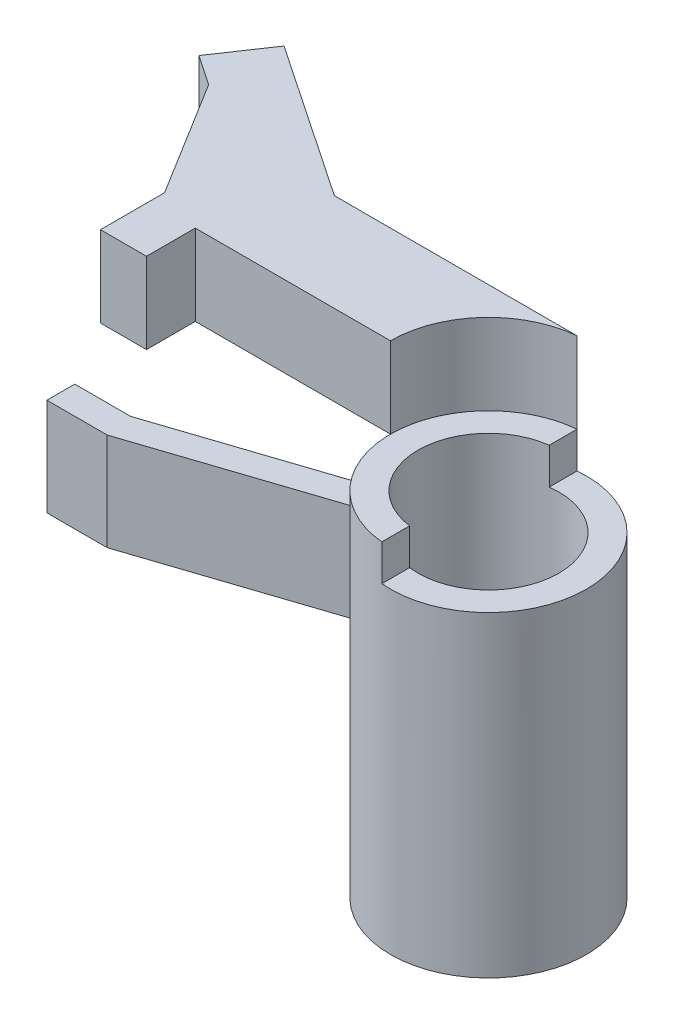
ISO-10303-21;
HEADER;
FILE_DESCRIPTION(('STEP AP214'),'2;1');
FILE_NAME('part.step','',(''),(''),'','','');
FILE_SCHEMA(('AUTOMOTIVE_DESIGN { 1 0 10303 214 1 1 1 1 }'));
ENDSEC;
DATA;
#1=APPLICATION_CONTEXT('core data for automotive mechanical design processes');
#2=APPLICATION_PROTOCOL_DEFINITION('international standard','automotive_design',2000,#1);
#3=PRODUCT_CONTEXT('',#1,'mechanical');
#4=PRODUCT('Part','Part','',(#3));
#5=PRODUCT_RELATED_PRODUCT_CATEGORY('part','',(#4));
#6=PRODUCT_DEFINITION_FORMATION('','',#4);
#7=PRODUCT_DEFINITION_CONTEXT('part definition',#1,'design');
#8=PRODUCT_DEFINITION('design','',#6,#7);
#9=PRODUCT_DEFINITION_SHAPE('','',#8);
#10=(LENGTH_UNIT() NAMED_UNIT(*) SI_UNIT(.MILLI.,.METRE.));
#11=(NAMED_UNIT(*) PLANE_ANGLE_UNIT() SI_UNIT($,.RADIAN.));
#12=(NAMED_UNIT(*) SI_UNIT($,.STERADIAN.) SOLID_ANGLE_UNIT());
#13=UNCERTAINTY_MEASURE_WITH_UNIT(LENGTH_MEASURE(1.E-05),#10,'distance_accuracy_value','');
#14=(GEOMETRIC_REPRESENTATION_CONTEXT(3) GLOBAL_UNCERTAINTY_ASSIGNED_CONTEXT((#13)) GLOBAL_UNIT_ASSIGNED_CONTEXT((#10,
#11,#12)) REPRESENTATION_CONTEXT('',''));
#15=CARTESIAN_POINT('',(0.,0.,0.));
#16=DIRECTION('',(0.,0.,1.));
#17=DIRECTION('',(1.,0.,0.));
#18=AXIS2_PLACEMENT_3D('',#15,#16,#17);
#19=CARTESIAN_POINT('',(0.,15.55,0.));
#20=DIRECTION('',(0.,-1.,0.));
#21=DIRECTION('',(0.,0.,-1.));
#22=AXIS2_PLACEMENT_3D('',#19,#20,#21);
#23=CYLINDRICAL_SURFACE('',#22,3.515);
#24=CARTESIAN_POINT('',(0.,12.65,0.));
#25=DIRECTION('',(0.,-1.,0.));
#26=DIRECTION('',(0.,0.,1.));
#27=AXIS2_PLACEMENT_3D('',#24,#25,#26);
#28=CIRCLE('',#27,3.515);
#29=CARTESIAN_POINT('',(-3.515,12.65,0.));
#30=VERTEX_POINT('',#29);
#31=CARTESIAN_POINT('',(-0.324384031666174,12.65,-3.5));
#32=VERTEX_POINT('',#31);
#33=EDGE_CURVE('E159',#30,#32,#28,.T.);
#34=ORIENTED_EDGE('',*,*,#33,.T.);
#35=DIRECTION('',(0.,-1.,0.));
#36=VECTOR('',#35,1.);
#37=CARTESIAN_POINT('',(-0.324384031666174,15.55,-3.5));
#38=LINE('',#37,#36);
#39=CARTESIAN_POINT('',(-0.324384031666174,15.55,-3.5));
#40=VERTEX_POINT('',#39);
#41=EDGE_CURVE('E12',#40,#32,#38,.T.);
#42=ORIENTED_EDGE('',*,*,#41,.F.);
#43=CARTESIAN_POINT('',(0.,15.55,0.));
#44=DIRECTION('',(0.,-1.,0.));
#45=DIRECTION('',(0.,0.,1.));
#46=AXIS2_PLACEMENT_3D('',#43,#44,#45);
#47=CIRCLE('',#46,3.515);
#48=CARTESIAN_POINT('',(-3.515,15.55,0.));
#49=VERTEX_POINT('',#48);
#50=EDGE_CURVE('E177',#49,#40,#47,.T.);
#51=ORIENTED_EDGE('',*,*,#50,.F.);
#52=DIRECTION('',(0.,-1.,0.));
#53=VECTOR('',#52,1.);
#54=CARTESIAN_POINT('',(-3.515,15.55,0.));
#55=LINE('',#54,#53);
#56=EDGE_CURVE('E155',#49,#30,#55,.T.);
#57=ORIENTED_EDGE('',*,*,#56,.T.);
#58=EDGE_LOOP('',(#34,#42,#51,#57));
#59=FACE_BOUND('',#58,.T.);
#60=ADVANCED_FACE('F51',(#59),#23,.F.);
#61=CARTESIAN_POINT('',(-0.324384031666174,15.55,-3.5));
#62=DIRECTION('',(0.,0.,1.));
#63=DIRECTION('',(1.,0.,0.));
#64=AXIS2_PLACEMENT_3D('',#61,#62,#63);
#65=PLANE('',#64);
#66=DIRECTION('',(-1.,0.,0.));
#67=VECTOR('',#66,1.);
#68=CARTESIAN_POINT('',(-0.324384031666174,12.65,-3.5));
#69=LINE('',#68,#67);
#70=CARTESIAN_POINT('',(-9.02438403166617,12.65,-3.5));
#71=VERTEX_POINT('',#70);
#72=EDGE_CURVE('E162',#32,#71,#69,.T.);
#73=ORIENTED_EDGE('',*,*,#72,.T.);
#74=DIRECTION('',(0.,-1.,0.));
#75=VECTOR('',#74,1.);
#76=CARTESIAN_POINT('',(-9.02438403166617,15.55,-3.5));
#77=LINE('',#76,#75);
#78=CARTESIAN_POINT('',(-9.02438403166617,15.55,-3.5));
#79=VERTEX_POINT('',#78);
#80=EDGE_CURVE('E59',#79,#71,#77,.T.);
#81=ORIENTED_EDGE('',*,*,#80,.F.);
#82=DIRECTION('',(-1.,0.,0.));
#83=VECTOR('',#82,1.);
#84=CARTESIAN_POINT('',(-0.324384031666174,15.55,-3.5));
#85=LINE('',#84,#83);
#86=EDGE_CURVE('E116',#40,#79,#85,.T.);
#87=ORIENTED_EDGE('',*,*,#86,.F.);
#88=ORIENTED_EDGE('',*,*,#41,.T.);
#89=EDGE_LOOP('',(#73,#81,#87,#88));
#90=FACE_BOUND('',#89,.T.);
#91=ADVANCED_FACE('F226',(#90),#65,.F.);
#92=CARTESIAN_POINT('',(-9.02438403166617,15.55,-3.5));
#93=DIRECTION('',(-0.559192903470748,0.,0.829037572555041));
#94=DIRECTION('',(0.829037572555041,0.,0.559192903470748));
#95=AXIS2_PLACEMENT_3D('',#92,#93,#94);
#96=PLANE('',#95);
#97=DIRECTION('',(-0.829037572555041,0.,-0.559192903470748));
#98=VECTOR('',#97,1.);
#99=CARTESIAN_POINT('',(-9.02438403166617,12.65,-3.5));
#100=LINE('',#99,#98);
#101=CARTESIAN_POINT('',(-14.5789357677849,12.65,-7.24659245325401));
#102=VERTEX_POINT('',#101);
#103=EDGE_CURVE('E164',#71,#102,#100,.T.);
#104=ORIENTED_EDGE('',*,*,#103,.T.);
#105=DIRECTION('',(0.,-1.,0.));
#106=VECTOR('',#105,1.);
#107=CARTESIAN_POINT('',(-14.5789357677849,15.55,-7.24659245325401));
#108=LINE('',#107,#106);
#109=CARTESIAN_POINT('',(-14.5789357677849,15.55,-7.24659245325401));
#110=VERTEX_POINT('',#109);
#111=EDGE_CURVE('E190',#110,#102,#108,.T.);
#112=ORIENTED_EDGE('',*,*,#111,.F.);
#113=DIRECTION('',(-0.829037572555041,0.,-0.559192903470748));
#114=VECTOR('',#113,1.);
#115=CARTESIAN_POINT('',(-9.02438403166617,15.55,-3.5));
#116=LINE('',#115,#114);
#117=EDGE_CURVE('E198',#79,#110,#116,.T.);
#118=ORIENTED_EDGE('',*,*,#117,.F.);
#119=ORIENTED_EDGE('',*,*,#80,.T.);
#120=EDGE_LOOP('',(#104,#112,#118,#119));
#121=FACE_BOUND('',#120,.T.);
#122=ADVANCED_FACE('F196',(#121),#96,.F.);
#123=CARTESIAN_POINT('',(-14.5789357677849,15.55,-7.24659245325401));
#124=DIRECTION('',(0.829037572555041,0.,0.559192903470748));
#125=DIRECTION('',(0.559192903470748,0.,-0.829037572555041));
#126=AXIS2_PLACEMENT_3D('',#123,#124,#125);
#127=PLANE('',#126);
#128=DIRECTION('',(-0.559192903470748,0.,0.829037572555041));
#129=VECTOR('',#128,1.);
#130=CARTESIAN_POINT('',(-14.5789357677849,12.65,-7.24659245325401));
#131=LINE('',#130,#129);
#132=CARTESIAN_POINT('',(-15.8091601554206,12.65,-5.42270979363292));
#133=VERTEX_POINT('',#132);
#134=EDGE_CURVE('E166',#102,#133,#131,.T.);
#135=ORIENTED_EDGE('',*,*,#134,.T.);
#136=DIRECTION('',(0.,-1.,0.));
#137=VECTOR('',#136,1.);
#138=CARTESIAN_POINT('',(-15.8091601554206,15.55,-5.42270979363292));
#139=LINE('',#138,#137);
#140=CARTESIAN_POINT('',(-15.8091601554206,15.55,-5.42270979363292));
#141=VERTEX_POINT('',#140);
#142=EDGE_CURVE('E187',#141,#133,#139,.T.);
#143=ORIENTED_EDGE('',*,*,#142,.F.);
#144=DIRECTION('',(-0.559192903470748,0.,0.829037572555041));
#145=VECTOR('',#144,1.);
#146=CARTESIAN_POINT('',(-14.5789357677849,15.55,-7.24659245325401));
#147=LINE('',#146,#145);
#148=EDGE_CURVE('E216',#110,#141,#147,.T.);
#149=ORIENTED_EDGE('',*,*,#148,.F.);
#150=ORIENTED_EDGE('',*,*,#111,.T.);
#151=EDGE_LOOP('',(#135,#143,#149,#150));
#152=FACE_BOUND('',#151,.T.);
#153=ADVANCED_FACE('F207',(#152),#127,.F.);
#154=CARTESIAN_POINT('',(-15.8091601554206,15.55,-5.42270979363292));
#155=DIRECTION('',(0.559192903470747,0.,-0.829037572555041));
#156=DIRECTION('',(-0.829037572555042,0.,-0.559192903470747));
#157=AXIS2_PLACEMENT_3D('',#154,#155,#156);
#158=PLANE('',#157);
#159=DIRECTION('',(0.829037572555041,0.,0.559192903470747));
#160=VECTOR('',#159,1.);
#161=CARTESIAN_POINT('',(-15.8091601554206,12.65,-5.42270979363292));
#162=LINE('',#161,#160);
#163=CARTESIAN_POINT('',(-14.731411311099,12.65,-4.69575901912095));
#164=VERTEX_POINT('',#163);
#165=EDGE_CURVE('E168',#133,#164,#162,.T.);
#166=ORIENTED_EDGE('',*,*,#165,.T.);
#167=DIRECTION('',(0.,-1.,0.));
#168=VECTOR('',#167,1.);
#169=CARTESIAN_POINT('',(-14.731411311099,15.55,-4.69575901912095));
#170=LINE('',#169,#168);
#171=CARTESIAN_POINT('',(-14.731411311099,15.55,-4.69575901912095));
#172=VERTEX_POINT('',#171);
#173=EDGE_CURVE('E184',#172,#164,#170,.T.);
#174=ORIENTED_EDGE('',*,*,#173,.F.);
#175=DIRECTION('',(0.829037572555041,0.,0.559192903470747));
#176=VECTOR('',#175,1.);
#177=CARTESIAN_POINT('',(-15.8091601554206,15.55,-5.42270979363292));
#178=LINE('',#177,#176);
#179=EDGE_CURVE('E213',#141,#172,#178,.T.);
#180=ORIENTED_EDGE('',*,*,#179,.F.);
#181=ORIENTED_EDGE('',*,*,#142,.T.);
#182=EDGE_LOOP('',(#166,#174,#180,#181));
#183=FACE_BOUND('',#182,.T.);
#184=ADVANCED_FACE('F211',(#183),#158,.F.);
#185=CARTESIAN_POINT('',(-12.165,15.55,-0.549999999999999));
#186=DIRECTION('',(0.850266150734693,0.,-0.526352992691034));
#187=DIRECTION('',(-0.526352992691034,0.,-0.850266150734693));
#188=AXIS2_PLACEMENT_3D('',#185,#186,#187);
#189=PLANE('',#188);
#190=DIRECTION('',(0.526352992691034,0.,0.850266150734693));
#191=VECTOR('',#190,1.);
#192=CARTESIAN_POINT('',(-12.165,12.65,-0.549999999999999));
#193=LINE('',#192,#191);
#194=CARTESIAN_POINT('',(-12.165,12.65,-0.549999999999999));
#195=VERTEX_POINT('',#194);
#196=EDGE_CURVE('E170',#164,#195,#193,.T.);
#197=ORIENTED_EDGE('',*,*,#196,.T.);
#198=DIRECTION('',(0.,-1.,0.));
#199=VECTOR('',#198,1.);
#200=CARTESIAN_POINT('',(-12.165,15.55,-0.549999999999999));
#201=LINE('',#200,#199);
#202=CARTESIAN_POINT('',(-12.165,15.55,-0.549999999999999));
#203=VERTEX_POINT('',#202);
#204=EDGE_CURVE('E181',#203,#195,#201,.T.);
#205=ORIENTED_EDGE('',*,*,#204,.F.);
#206=DIRECTION('',(0.526352992691034,0.,0.850266150734693));
#207=VECTOR('',#206,1.);
#208=CARTESIAN_POINT('',(-12.165,15.55,-0.549999999999999));
#209=LINE('',#208,#207);
#210=EDGE_CURVE('E215',#172,#203,#209,.T.);
#211=ORIENTED_EDGE('',*,*,#210,.F.);
#212=ORIENTED_EDGE('',*,*,#173,.T.);
#213=EDGE_LOOP('',(#197,#205,#211,#212));
#214=FACE_BOUND('',#213,.T.);
#215=ADVANCED_FACE('F238',(#214),#189,.F.);
#216=CARTESIAN_POINT('',(-12.165,15.55,1.75));
#217=DIRECTION('',(1.,0.,0.));
#218=DIRECTION('',(0.,0.,-1.));
#219=AXIS2_PLACEMENT_3D('',#216,#217,#218);
#220=PLANE('',#219);
#221=DIRECTION('',(0.,0.,1.));
#222=VECTOR('',#221,1.);
#223=CARTESIAN_POINT('',(-12.165,12.65,1.75));
#224=LINE('',#223,#222);
#225=CARTESIAN_POINT('',(-12.165,12.65,1.75));
#226=VERTEX_POINT('',#225);
#227=EDGE_CURVE('E172',#195,#226,#224,.T.);
#228=ORIENTED_EDGE('',*,*,#227,.T.);
#229=DIRECTION('',(0.,-1.,0.));
#230=VECTOR('',#229,1.);
#231=CARTESIAN_POINT('',(-12.165,15.55,1.75));
#232=LINE('',#231,#230);
#233=CARTESIAN_POINT('',(-12.165,15.55,1.75));
#234=VERTEX_POINT('',#233);
#235=EDGE_CURVE('E150',#234,#226,#232,.T.);
#236=ORIENTED_EDGE('',*,*,#235,.F.);
#237=DIRECTION('',(0.,0.,1.));
#238=VECTOR('',#237,1.);
#239=CARTESIAN_POINT('',(-12.165,15.55,1.75));
#240=LINE('',#239,#238);
#241=EDGE_CURVE('E141',#203,#234,#240,.T.);
#242=ORIENTED_EDGE('',*,*,#241,.F.);
#243=ORIENTED_EDGE('',*,*,#204,.T.);
#244=EDGE_LOOP('',(#228,#236,#242,#243));
#245=FACE_BOUND('',#244,.T.);
#246=ADVANCED_FACE('F241',(#245),#220,.F.);
#247=CARTESIAN_POINT('',(-10.515,15.55,1.75));
#248=DIRECTION('',(0.,0.,-1.));
#249=DIRECTION('',(-1.,0.,0.));
#250=AXIS2_PLACEMENT_3D('',#247,#248,#249);
#251=PLANE('',#250);
#252=DIRECTION('',(1.,0.,0.));
#253=VECTOR('',#252,1.);
#254=CARTESIAN_POINT('',(-10.515,12.65,1.75));
#255=LINE('',#254,#253);
#256=CARTESIAN_POINT('',(-10.515,12.65,1.75));
#257=VERTEX_POINT('',#256);
#258=EDGE_CURVE('E149',#226,#257,#255,.T.);
#259=ORIENTED_EDGE('',*,*,#258,.T.);
#260=DIRECTION('',(0.,-1.,0.));
#261=VECTOR('',#260,1.);
#262=CARTESIAN_POINT('',(-10.515,15.55,1.75));
#263=LINE('',#262,#261);
#264=CARTESIAN_POINT('',(-10.515,15.55,1.75));
#265=VERTEX_POINT('',#264);
#266=EDGE_CURVE('E146',#265,#257,#263,.T.);
#267=ORIENTED_EDGE('',*,*,#266,.F.);
#268=DIRECTION('',(1.,0.,0.));
#269=VECTOR('',#268,1.);
#270=CARTESIAN_POINT('',(-10.515,15.55,1.75));
#271=LINE('',#270,#269);
#272=EDGE_CURVE('E135',#234,#265,#271,.T.);
#273=ORIENTED_EDGE('',*,*,#272,.F.);
#274=ORIENTED_EDGE('',*,*,#235,.T.);
#275=EDGE_LOOP('',(#259,#267,#273,#274));
#276=FACE_BOUND('',#275,.T.);
#277=ADVANCED_FACE('F147',(#276),#251,.F.);
#278=CARTESIAN_POINT('',(-10.515,15.55,0.));
#279=DIRECTION('',(-1.,0.,0.));
#280=DIRECTION('',(0.,0.,1.));
#281=AXIS2_PLACEMENT_3D('',#278,#279,#280);
#282=PLANE('',#281);
#283=DIRECTION('',(0.,0.,-1.));
#284=VECTOR('',#283,1.);
#285=CARTESIAN_POINT('',(-10.515,12.65,0.));
#286=LINE('',#285,#284);
#287=CARTESIAN_POINT('',(-10.515,12.65,0.));
#288=VERTEX_POINT('',#287);
#289=EDGE_CURVE('E102',#257,#288,#286,.T.);
#290=ORIENTED_EDGE('',*,*,#289,.T.);
#291=DIRECTION('',(0.,-1.,0.));
#292=VECTOR('',#291,1.);
#293=CARTESIAN_POINT('',(-10.515,15.55,0.));
#294=LINE('',#293,#292);
#295=CARTESIAN_POINT('',(-10.515,15.55,0.));
#296=VERTEX_POINT('',#295);
#297=EDGE_CURVE('E151',#296,#288,#294,.T.);
#298=ORIENTED_EDGE('',*,*,#297,.F.);
#299=DIRECTION('',(0.,0.,-1.));
#300=VECTOR('',#299,1.);
#301=CARTESIAN_POINT('',(-10.515,15.55,0.));
#302=LINE('',#301,#300);
#303=EDGE_CURVE('E139',#265,#296,#302,.T.);
#304=ORIENTED_EDGE('',*,*,#303,.F.);
#305=ORIENTED_EDGE('',*,*,#266,.T.);
#306=EDGE_LOOP('',(#290,#298,#304,#305));
#307=FACE_BOUND('',#306,.T.);
#308=ADVANCED_FACE('F153',(#307),#282,.F.);
#309=CARTESIAN_POINT('',(-3.515,15.55,0.));
#310=DIRECTION('',(0.,0.,-1.));
#311=DIRECTION('',(-1.,0.,0.));
#312=AXIS2_PLACEMENT_3D('',#309,#310,#311);
#313=PLANE('',#312);
#314=DIRECTION('',(1.,0.,0.));
#315=VECTOR('',#314,1.);
#316=CARTESIAN_POINT('',(-3.515,12.65,0.));
#317=LINE('',#316,#315);
#318=EDGE_CURVE('E108',#288,#30,#317,.T.);
#319=ORIENTED_EDGE('',*,*,#318,.T.);
#320=ORIENTED_EDGE('',*,*,#56,.F.);
#321=DIRECTION('',(1.,0.,0.));
#322=VECTOR('',#321,1.);
#323=CARTESIAN_POINT('',(-3.515,15.55,0.));
#324=LINE('',#323,#322);
#325=EDGE_CURVE('E67',#296,#49,#324,.T.);
#326=ORIENTED_EDGE('',*,*,#325,.F.);
#327=ORIENTED_EDGE('',*,*,#297,.T.);
#328=EDGE_LOOP('',(#319,#320,#326,#327));
#329=FACE_BOUND('',#328,.T.);
#330=ADVANCED_FACE('F250',(#329),#313,.F.);
#331=CARTESIAN_POINT('',(0.,15.55,0.));
#332=DIRECTION('',(0.,1.,0.));
#333=DIRECTION('',(0.,0.,1.));
#334=AXIS2_PLACEMENT_3D('',#331,#332,#333);
#335=PLANE('',#334);
#336=ORIENTED_EDGE('',*,*,#50,.T.);
#337=ORIENTED_EDGE('',*,*,#86,.T.);
#338=ORIENTED_EDGE('',*,*,#117,.T.);
#339=ORIENTED_EDGE('',*,*,#148,.T.);
#340=ORIENTED_EDGE('',*,*,#179,.T.);
#341=ORIENTED_EDGE('',*,*,#210,.T.);
#342=ORIENTED_EDGE('',*,*,#241,.T.);
#343=ORIENTED_EDGE('',*,*,#272,.T.);
#344=ORIENTED_EDGE('',*,*,#303,.T.);
#345=ORIENTED_EDGE('',*,*,#325,.T.);
#346=EDGE_LOOP('',(#336,#337,#338,#339,#340,#341,#342,#343,#344,#345));
#347=FACE_BOUND('',#346,.T.);
#348=ADVANCED_FACE('F137',(#347),#335,.T.);
#349=CARTESIAN_POINT('',(0.,12.65,0.));
#350=DIRECTION('',(0.,1.,0.));
#351=DIRECTION('',(0.,0.,1.));
#352=AXIS2_PLACEMENT_3D('',#349,#350,#351);
#353=PLANE('',#352);
#354=ORIENTED_EDGE('',*,*,#33,.F.);
#355=ORIENTED_EDGE('',*,*,#318,.F.);
#356=ORIENTED_EDGE('',*,*,#289,.F.);
#357=ORIENTED_EDGE('',*,*,#258,.F.);
#358=ORIENTED_EDGE('',*,*,#227,.F.);
#359=ORIENTED_EDGE('',*,*,#196,.F.);
#360=ORIENTED_EDGE('',*,*,#165,.F.);
#361=ORIENTED_EDGE('',*,*,#134,.F.);
#362=ORIENTED_EDGE('',*,*,#103,.F.);
#363=ORIENTED_EDGE('',*,*,#72,.F.);
#364=EDGE_LOOP('',(#354,#355,#356,#357,#358,#359,#360,#361,#362,#363));
#365=FACE_BOUND('',#364,.T.);
#366=ADVANCED_FACE('F202',(#365),#353,.F.);
#367=CLOSED_SHELL('',(#60,#91,#122,#153,#184,#215,#246,#277,#308,#330,#348,#366));
#368=MANIFOLD_SOLID_BREP('B2',#367);
#369=CARTESIAN_POINT('',(0.,11.35,0.));
#370=DIRECTION('',(0.,-1.,0.));
#371=DIRECTION('',(0.,0.,-1.));
#372=AXIS2_PLACEMENT_3D('',#369,#370,#371);
#373=CYLINDRICAL_SURFACE('',#372,3.515);
#374=CARTESIAN_POINT('',(0.,0.,0.));
#375=DIRECTION('',(0.,1.,0.));
#376=DIRECTION('',(0.,0.,1.));
#377=AXIS2_PLACEMENT_3D('',#374,#375,#376);
#378=CIRCLE('',#377,3.515);
#379=CARTESIAN_POINT('',(0.,0.,3.515));
#380=VERTEX_POINT('',#379);
#381=EDGE_CURVE('E334',#380,#380,#378,.T.);
#382=ORIENTED_EDGE('',*,*,#381,.T.);
#383=EDGE_LOOP('',(#382));
#384=FACE_BOUND('',#383,.T.);
#385=CARTESIAN_POINT('',(0.,11.35,0.));
#386=DIRECTION('',(0.,1.,0.));
#387=DIRECTION('',(0.,0.,1.));
#388=AXIS2_PLACEMENT_3D('',#385,#386,#387);
#389=CIRCLE('',#388,3.515);
#390=CARTESIAN_POINT('',(-0.324384031666175,11.35,3.5));
#391=VERTEX_POINT('',#390);
#392=CARTESIAN_POINT('',(-0.324384031666174,11.35,-3.5));
#393=VERTEX_POINT('',#392);
#394=EDGE_CURVE('E49',#391,#393,#389,.T.);
#395=ORIENTED_EDGE('',*,*,#394,.F.);
#396=DIRECTION('',(0.,-1.,0.));
#397=VECTOR('',#396,1.);
#398=CARTESIAN_POINT('',(-0.324384031666175,12.65,3.5));
#399=LINE('',#398,#397);
#400=CARTESIAN_POINT('',(-0.324384031666175,12.65,3.5));
#401=VERTEX_POINT('',#400);
#402=EDGE_CURVE('E479',#401,#391,#399,.T.);
#403=ORIENTED_EDGE('',*,*,#402,.F.);
#404=CARTESIAN_POINT('',(0.,12.65,0.));
#405=DIRECTION('',(0.,1.,0.));
#406=DIRECTION('',(0.,0.,1.));
#407=AXIS2_PLACEMENT_3D('',#404,#405,#406);
#408=CIRCLE('',#407,3.515);
#409=CARTESIAN_POINT('',(-0.324384031666174,12.65,-3.5));
#410=VERTEX_POINT('',#409);
#411=EDGE_CURVE('E469',#410,#401,#408,.T.);
#412=ORIENTED_EDGE('',*,*,#411,.F.);
#413=DIRECTION('',(0.,-1.,0.));
#414=VECTOR('',#413,1.);
#415=CARTESIAN_POINT('',(-0.324384031666174,12.65,-3.5));
#416=LINE('',#415,#414);
#417=EDGE_CURVE('E482',#410,#393,#416,.T.);
#418=ORIENTED_EDGE('',*,*,#417,.T.);
#419=EDGE_LOOP('',(#395,#403,#412,#418));
#420=FACE_BOUND('',#419,.T.);
#421=CARTESIAN_POINT('',(0.,8.15,0.));
#422=DIRECTION('',(0.,-1.,0.));
#423=DIRECTION('',(0.,0.,1.));
#424=AXIS2_PLACEMENT_3D('',#421,#422,#423);
#425=CIRCLE('',#424,3.515);
#426=CARTESIAN_POINT('',(-2.94830710841096,8.15,1.91382083657102));
#427=VERTEX_POINT('',#426);
#428=CARTESIAN_POINT('',(-3.36975147451559,8.15,1.));
#429=VERTEX_POINT('',#428);
#430=EDGE_CURVE('E424',#427,#429,#425,.T.);
#431=ORIENTED_EDGE('',*,*,#430,.T.);
#432=DIRECTION('',(0.,1.,0.));
#433=VECTOR('',#432,1.);
#434=CARTESIAN_POINT('',(-3.36975147451559,8.15,1.));
#435=LINE('',#434,#433);
#436=CARTESIAN_POINT('',(-3.36975147451559,11.65,1.));
#437=VERTEX_POINT('',#436);
#438=EDGE_CURVE('E408',#429,#437,#435,.T.);
#439=ORIENTED_EDGE('',*,*,#438,.T.);
#440=CARTESIAN_POINT('',(0.,11.65,0.));
#441=DIRECTION('',(0.,-1.,0.));
#442=DIRECTION('',(0.,0.,1.));
#443=AXIS2_PLACEMENT_3D('',#440,#441,#442);
#444=CIRCLE('',#443,3.515);
#445=CARTESIAN_POINT('',(-2.94830710841096,11.65,1.91382083657102));
#446=VERTEX_POINT('',#445);
#447=EDGE_CURVE('E444',#446,#437,#444,.T.);
#448=ORIENTED_EDGE('',*,*,#447,.F.);
#449=DIRECTION('',(0.,1.,0.));
#450=VECTOR('',#449,1.);
#451=CARTESIAN_POINT('',(-2.94830710841096,8.15,1.91382083657102));
#452=LINE('',#451,#450);
#453=EDGE_CURVE('E431',#427,#446,#452,.T.);
#454=ORIENTED_EDGE('',*,*,#453,.F.);
#455=EDGE_LOOP('',(#431,#439,#448,#454));
#456=FACE_BOUND('',#455,.T.);
#457=ADVANCED_FACE('F331',(#384,#420,#456),#373,.T.);
#458=CARTESIAN_POINT('',(0.,11.35,0.));
#459=DIRECTION('',(0.,1.,0.));
#460=DIRECTION('',(0.,0.,1.));
#461=AXIS2_PLACEMENT_3D('',#458,#459,#460);
#462=PLANE('',#461);
#463=DIRECTION('',(0.,0.,-1.));
#464=VECTOR('',#463,1.);
#465=CARTESIAN_POINT('',(-0.324384031666175,11.35,2.50407667614233));
#466=LINE('',#465,#464);
#467=CARTESIAN_POINT('',(-0.324384031666175,11.35,2.50407667614233));
#468=VERTEX_POINT('',#467);
#469=EDGE_CURVE('E467',#391,#468,#466,.T.);
#470=ORIENTED_EDGE('',*,*,#469,.F.);
#471=ORIENTED_EDGE('',*,*,#394,.T.);
#472=DIRECTION('',(0.,0.,-1.));
#473=VECTOR('',#472,1.);
#474=CARTESIAN_POINT('',(-0.324384031666175,11.35,-3.5));
#475=LINE('',#474,#473);
#476=CARTESIAN_POINT('',(-0.324384031666175,11.35,-2.50407667614233));
#477=VERTEX_POINT('',#476);
#478=EDGE_CURVE('E455',#477,#393,#475,.T.);
#479=ORIENTED_EDGE('',*,*,#478,.F.);
#480=CARTESIAN_POINT('',(0.,11.35,0.));
#481=DIRECTION('',(0.,1.,0.));
#482=DIRECTION('',(0.,0.,1.));
#483=AXIS2_PLACEMENT_3D('',#480,#481,#482);
#484=CIRCLE('',#483,2.525);
#485=EDGE_CURVE('E353',#468,#477,#484,.T.);
#486=ORIENTED_EDGE('',*,*,#485,.F.);
#487=EDGE_LOOP('',(#470,#471,#479,#486));
#488=FACE_BOUND('',#487,.T.);
#489=ADVANCED_FACE('F508',(#488),#462,.T.);
#490=CARTESIAN_POINT('',(0.,0.,0.));
#491=DIRECTION('',(0.,1.,0.));
#492=DIRECTION('',(0.,0.,1.));
#493=AXIS2_PLACEMENT_3D('',#490,#491,#492);
#494=PLANE('',#493);
#495=ORIENTED_EDGE('',*,*,#381,.F.);
#496=EDGE_LOOP('',(#495));
#497=FACE_BOUND('',#496,.T.);
#498=CARTESIAN_POINT('',(0.,0.,0.));
#499=DIRECTION('',(0.,1.,0.));
#500=DIRECTION('',(0.,0.,1.));
#501=AXIS2_PLACEMENT_3D('',#498,#499,#500);
#502=CIRCLE('',#501,2.525);
#503=CARTESIAN_POINT('',(0.,0.,2.525));
#504=VERTEX_POINT('',#503);
#505=EDGE_CURVE('E488',#504,#504,#502,.T.);
#506=ORIENTED_EDGE('',*,*,#505,.T.);
#507=EDGE_LOOP('',(#506));
#508=FACE_BOUND('',#507,.T.);
#509=ADVANCED_FACE('F493',(#497,#508),#494,.F.);
#510=CARTESIAN_POINT('',(0.,11.35,0.));
#511=DIRECTION('',(0.,-1.,0.));
#512=DIRECTION('',(0.,0.,-1.));
#513=AXIS2_PLACEMENT_3D('',#510,#511,#512);
#514=CYLINDRICAL_SURFACE('',#513,2.525);
#515=ORIENTED_EDGE('',*,*,#485,.T.);
#516=DIRECTION('',(0.,-1.,0.));
#517=VECTOR('',#516,1.);
#518=CARTESIAN_POINT('',(-0.324384031666175,12.65,-2.50407667614233));
#519=LINE('',#518,#517);
#520=CARTESIAN_POINT('',(-0.324384031666175,12.65,-2.50407667614233));
#521=VERTEX_POINT('',#520);
#522=EDGE_CURVE('E485',#521,#477,#519,.T.);
#523=ORIENTED_EDGE('',*,*,#522,.F.);
#524=CARTESIAN_POINT('',(0.,12.65,0.));
#525=DIRECTION('',(0.,-1.,0.));
#526=DIRECTION('',(0.,0.,1.));
#527=AXIS2_PLACEMENT_3D('',#524,#525,#526);
#528=CIRCLE('',#527,2.525);
#529=CARTESIAN_POINT('',(-0.324384031666175,12.65,2.50407667614233));
#530=VERTEX_POINT('',#529);
#531=EDGE_CURVE('E463',#530,#521,#528,.T.);
#532=ORIENTED_EDGE('',*,*,#531,.F.);
#533=DIRECTION('',(0.,-1.,0.));
#534=VECTOR('',#533,1.);
#535=CARTESIAN_POINT('',(-0.324384031666175,12.65,2.50407667614233));
#536=LINE('',#535,#534);
#537=EDGE_CURVE('E473',#530,#468,#536,.T.);
#538=ORIENTED_EDGE('',*,*,#537,.T.);
#539=EDGE_LOOP('',(#515,#523,#532,#538));
#540=FACE_BOUND('',#539,.T.);
#541=ORIENTED_EDGE('',*,*,#505,.F.);
#542=EDGE_LOOP('',(#541));
#543=FACE_BOUND('',#542,.T.);
#544=ADVANCED_FACE('F495',(#540,#543),#514,.F.);
#545=CARTESIAN_POINT('',(-0.324384031666175,12.65,-3.5));
#546=DIRECTION('',(-1.,0.,0.));
#547=DIRECTION('',(0.,0.,1.));
#548=AXIS2_PLACEMENT_3D('',#545,#546,#547);
#549=PLANE('',#548);
#550=ORIENTED_EDGE('',*,*,#478,.T.);
#551=ORIENTED_EDGE('',*,*,#417,.F.);
#552=DIRECTION('',(0.,0.,-1.));
#553=VECTOR('',#552,1.);
#554=CARTESIAN_POINT('',(-0.324384031666175,12.65,-3.5));
#555=LINE('',#554,#553);
#556=EDGE_CURVE('E466',#521,#410,#555,.T.);
#557=ORIENTED_EDGE('',*,*,#556,.F.);
#558=ORIENTED_EDGE('',*,*,#522,.T.);
#559=EDGE_LOOP('',(#550,#551,#557,#558));
#560=FACE_BOUND('',#559,.T.);
#561=ADVANCED_FACE('F497',(#560),#549,.F.);
#562=CARTESIAN_POINT('',(-0.324384031666175,12.65,2.50407667614233));
#563=DIRECTION('',(-1.,0.,0.));
#564=DIRECTION('',(0.,0.,1.));
#565=AXIS2_PLACEMENT_3D('',#562,#563,#564);
#566=PLANE('',#565);
#567=ORIENTED_EDGE('',*,*,#469,.T.);
#568=ORIENTED_EDGE('',*,*,#537,.F.);
#569=DIRECTION('',(0.,0.,-1.));
#570=VECTOR('',#569,1.);
#571=CARTESIAN_POINT('',(-0.324384031666175,12.65,2.50407667614233));
#572=LINE('',#571,#570);
#573=EDGE_CURVE('E471',#401,#530,#572,.T.);
#574=ORIENTED_EDGE('',*,*,#573,.F.);
#575=ORIENTED_EDGE('',*,*,#402,.T.);
#576=EDGE_LOOP('',(#567,#568,#574,#575));
#577=FACE_BOUND('',#576,.T.);
#578=ADVANCED_FACE('F504',(#577),#566,.F.);
#579=CARTESIAN_POINT('',(0.,12.65,0.));
#580=DIRECTION('',(0.,1.,0.));
#581=DIRECTION('',(0.,0.,1.));
#582=AXIS2_PLACEMENT_3D('',#579,#580,#581);
#583=PLANE('',#582);
#584=ORIENTED_EDGE('',*,*,#531,.T.);
#585=ORIENTED_EDGE('',*,*,#556,.T.);
#586=ORIENTED_EDGE('',*,*,#411,.T.);
#587=ORIENTED_EDGE('',*,*,#573,.T.);
#588=EDGE_LOOP('',(#584,#585,#586,#587));
#589=FACE_BOUND('',#588,.T.);
#590=ADVANCED_FACE('F529',(#589),#583,.T.);
#591=CARTESIAN_POINT('',(-9.56832863714964,8.15,4.1074034439261));
#592=DIRECTION('',(0.314537827451657,0.,0.949244939466096));
#593=DIRECTION('',(0.949244939466096,0.,-0.314537827451657));
#594=AXIS2_PLACEMENT_3D('',#591,#592,#593);
#595=PLANE('',#594);
#596=DIRECTION('',(0.949244939466096,0.,-0.314537827451657));
#597=VECTOR('',#596,1.);
#598=CARTESIAN_POINT('',(-9.56832863714964,11.65,4.1074034439261));
#599=LINE('',#598,#597);
#600=CARTESIAN_POINT('',(-9.56832863714964,11.65,4.1074034439261));
#601=VERTEX_POINT('',#600);
#602=EDGE_CURVE('E345',#601,#446,#599,.T.);
#603=ORIENTED_EDGE('',*,*,#602,.F.);
#604=DIRECTION('',(0.,1.,0.));
#605=VECTOR('',#604,1.);
#606=CARTESIAN_POINT('',(-9.56832863714964,8.15,4.1074034439261));
#607=LINE('',#606,#605);
#608=CARTESIAN_POINT('',(-9.56832863714964,8.15,4.1074034439261));
#609=VERTEX_POINT('',#608);
#610=EDGE_CURVE('E456',#609,#601,#607,.T.);
#611=ORIENTED_EDGE('',*,*,#610,.F.);
#612=DIRECTION('',(0.949244939466096,0.,-0.314537827451657));
#613=VECTOR('',#612,1.);
#614=CARTESIAN_POINT('',(-9.56832863714964,8.15,4.1074034439261));
#615=LINE('',#614,#613);
#616=EDGE_CURVE('E418',#609,#427,#615,.T.);
#617=ORIENTED_EDGE('',*,*,#616,.T.);
#618=ORIENTED_EDGE('',*,*,#453,.T.);
#619=EDGE_LOOP('',(#603,#611,#617,#618));
#620=FACE_BOUND('',#619,.T.);
#621=ADVANCED_FACE('F531',(#620),#595,.T.);
#622=CARTESIAN_POINT('',(-11.7296925689384,8.15,4.10594064445718));
#623=DIRECTION('',(-0.000676794459457443,0.,0.999999770974604));
#624=DIRECTION('',(0.999999770974604,0.,0.000676794459457443));
#625=AXIS2_PLACEMENT_3D('',#622,#623,#624);
#626=PLANE('',#625);
#627=DIRECTION('',(0.999999770974604,0.,0.000676794459457443));
#628=VECTOR('',#627,1.);
#629=CARTESIAN_POINT('',(-11.7296925689384,11.65,4.10594064445718));
#630=LINE('',#629,#628);
#631=CARTESIAN_POINT('',(-11.7296925689384,11.65,4.10594064445718));
#632=VERTEX_POINT('',#631);
#633=EDGE_CURVE('E433',#632,#601,#630,.T.);
#634=ORIENTED_EDGE('',*,*,#633,.F.);
#635=DIRECTION('',(0.,1.,0.));
#636=VECTOR('',#635,1.);
#637=CARTESIAN_POINT('',(-11.7296925689384,8.15,4.10594064445718));
#638=LINE('',#637,#636);
#639=CARTESIAN_POINT('',(-11.7296925689384,8.15,4.10594064445718));
#640=VERTEX_POINT('',#639);
#641=EDGE_CURVE('E458',#640,#632,#638,.T.);
#642=ORIENTED_EDGE('',*,*,#641,.F.);
#643=DIRECTION('',(0.999999770974604,0.,0.000676794459457443));
#644=VECTOR('',#643,1.);
#645=CARTESIAN_POINT('',(-11.7296925689384,8.15,4.10594064445718));
#646=LINE('',#645,#644);
#647=EDGE_CURVE('E440',#640,#609,#646,.T.);
#648=ORIENTED_EDGE('',*,*,#647,.T.);
#649=ORIENTED_EDGE('',*,*,#610,.T.);
#650=EDGE_LOOP('',(#634,#642,#648,#649));
#651=FACE_BOUND('',#650,.T.);
#652=ADVANCED_FACE('F536',(#651),#626,.T.);
#653=CARTESIAN_POINT('',(-11.7296925689384,8.15,3.1074034439261));
#654=DIRECTION('',(-1.,0.,0.));
#655=DIRECTION('',(0.,0.,1.));
#656=AXIS2_PLACEMENT_3D('',#653,#654,#655);
#657=PLANE('',#656);
#658=DIRECTION('',(0.,0.,1.));
#659=VECTOR('',#658,1.);
#660=CARTESIAN_POINT('',(-11.7296925689384,11.65,3.1074034439261));
#661=LINE('',#660,#659);
#662=CARTESIAN_POINT('',(-11.7296925689384,11.65,3.1074034439261));
#663=VERTEX_POINT('',#662);
#664=EDGE_CURVE('E450',#663,#632,#661,.T.);
#665=ORIENTED_EDGE('',*,*,#664,.F.);
#666=DIRECTION('',(0.,1.,0.));
#667=VECTOR('',#666,1.);
#668=CARTESIAN_POINT('',(-11.7296925689384,8.15,3.1074034439261));
#669=LINE('',#668,#667);
#670=CARTESIAN_POINT('',(-11.7296925689384,8.15,3.1074034439261));
#671=VERTEX_POINT('',#670);
#672=EDGE_CURVE('E460',#671,#663,#669,.T.);
#673=ORIENTED_EDGE('',*,*,#672,.F.);
#674=DIRECTION('',(0.,0.,1.));
#675=VECTOR('',#674,1.);
#676=CARTESIAN_POINT('',(-11.7296925689384,8.15,3.1074034439261));
#677=LINE('',#676,#675);
#678=EDGE_CURVE('E437',#671,#640,#677,.T.);
#679=ORIENTED_EDGE('',*,*,#678,.T.);
#680=ORIENTED_EDGE('',*,*,#641,.T.);
#681=EDGE_LOOP('',(#665,#673,#679,#680));
#682=FACE_BOUND('',#681,.T.);
#683=ADVANCED_FACE('F546',(#682),#657,.T.);
#684=CARTESIAN_POINT('',(-9.72969256893843,8.15,3.1074034439261));
#685=DIRECTION('',(0.,0.,-1.));
#686=DIRECTION('',(-1.,0.,0.));
#687=AXIS2_PLACEMENT_3D('',#684,#685,#686);
#688=PLANE('',#687);
#689=DIRECTION('',(-1.,0.,0.));
#690=VECTOR('',#689,1.);
#691=CARTESIAN_POINT('',(-9.72969256893843,11.65,3.1074034439261));
#692=LINE('',#691,#690);
#693=CARTESIAN_POINT('',(-9.72969256893843,11.65,3.1074034439261));
#694=VERTEX_POINT('',#693);
#695=EDGE_CURVE('E447',#694,#663,#692,.T.);
#696=ORIENTED_EDGE('',*,*,#695,.F.);
#697=DIRECTION('',(0.,1.,0.));
#698=VECTOR('',#697,1.);
#699=CARTESIAN_POINT('',(-9.72969256893843,8.15,3.1074034439261));
#700=LINE('',#699,#698);
#701=CARTESIAN_POINT('',(-9.72969256893843,8.15,3.1074034439261));
#702=VERTEX_POINT('',#701);
#703=EDGE_CURVE('E417',#702,#694,#700,.T.);
#704=ORIENTED_EDGE('',*,*,#703,.F.);
#705=DIRECTION('',(-1.,0.,0.));
#706=VECTOR('',#705,1.);
#707=CARTESIAN_POINT('',(-9.72969256893843,8.15,3.1074034439261));
#708=LINE('',#707,#706);
#709=EDGE_CURVE('E428',#702,#671,#708,.T.);
#710=ORIENTED_EDGE('',*,*,#709,.T.);
#711=ORIENTED_EDGE('',*,*,#672,.T.);
#712=EDGE_LOOP('',(#696,#704,#710,#711));
#713=FACE_BOUND('',#712,.T.);
#714=ADVANCED_FACE('F543',(#713),#688,.T.);
#715=CARTESIAN_POINT('',(-3.36975147451559,8.15,1.));
#716=DIRECTION('',(-0.314537827451657,0.,-0.949244939466096));
#717=DIRECTION('',(-0.949244939466096,0.,0.314537827451657));
#718=AXIS2_PLACEMENT_3D('',#715,#716,#717);
#719=PLANE('',#718);
#720=DIRECTION('',(-0.949244939466096,0.,0.314537827451657));
#721=VECTOR('',#720,1.);
#722=CARTESIAN_POINT('',(-3.36975147451559,11.65,1.));
#723=LINE('',#722,#721);
#724=EDGE_CURVE('E413',#437,#694,#723,.T.);
#725=ORIENTED_EDGE('',*,*,#724,.F.);
#726=ORIENTED_EDGE('',*,*,#438,.F.);
#727=DIRECTION('',(-0.949244939466096,0.,0.314537827451657));
#728=VECTOR('',#727,1.);
#729=CARTESIAN_POINT('',(-3.36975147451559,8.15,1.));
#730=LINE('',#729,#728);
#731=EDGE_CURVE('E411',#429,#702,#730,.T.);
#732=ORIENTED_EDGE('',*,*,#731,.T.);
#733=ORIENTED_EDGE('',*,*,#703,.T.);
#734=EDGE_LOOP('',(#725,#726,#732,#733));
#735=FACE_BOUND('',#734,.T.);
#736=ADVANCED_FACE('F410',(#735),#719,.T.);
#737=CARTESIAN_POINT('',(0.,8.15,0.));
#738=DIRECTION('',(0.,1.,0.));
#739=DIRECTION('',(0.,0.,1.));
#740=AXIS2_PLACEMENT_3D('',#737,#738,#739);
#741=PLANE('',#740);
#742=ORIENTED_EDGE('',*,*,#430,.F.);
#743=ORIENTED_EDGE('',*,*,#616,.F.);
#744=ORIENTED_EDGE('',*,*,#647,.F.);
#745=ORIENTED_EDGE('',*,*,#678,.F.);
#746=ORIENTED_EDGE('',*,*,#709,.F.);
#747=ORIENTED_EDGE('',*,*,#731,.F.);
#748=EDGE_LOOP('',(#742,#743,#744,#745,#746,#747));
#749=FACE_BOUND('',#748,.T.);
#750=ADVANCED_FACE('F422',(#749),#741,.F.);
#751=CARTESIAN_POINT('',(0.,11.65,0.));
#752=DIRECTION('',(0.,1.,0.));
#753=DIRECTION('',(0.,0.,1.));
#754=AXIS2_PLACEMENT_3D('',#751,#752,#753);
#755=PLANE('',#754);
#756=ORIENTED_EDGE('',*,*,#447,.T.);
#757=ORIENTED_EDGE('',*,*,#724,.T.);
#758=ORIENTED_EDGE('',*,*,#695,.T.);
#759=ORIENTED_EDGE('',*,*,#664,.T.);
#760=ORIENTED_EDGE('',*,*,#633,.T.);
#761=ORIENTED_EDGE('',*,*,#602,.T.);
#762=EDGE_LOOP('',(#756,#757,#758,#759,#760,#761));
#763=FACE_BOUND('',#762,.T.);
#764=ADVANCED_FACE('F554',(#763),#755,.T.);
#765=CLOSED_SHELL('',(#457,#489,#509,#544,#561,#578,#590,#621,#652,#683,#714,#736,#750,#764));
#766=MANIFOLD_SOLID_BREP('B6',#765);
#767=ADVANCED_BREP_SHAPE_REPRESENTATION('',(#18,#368,#766),#14);
#768=SHAPE_DEFINITION_REPRESENTATION(#9,#767);
ENDSEC;
END-ISO-10303-21;
